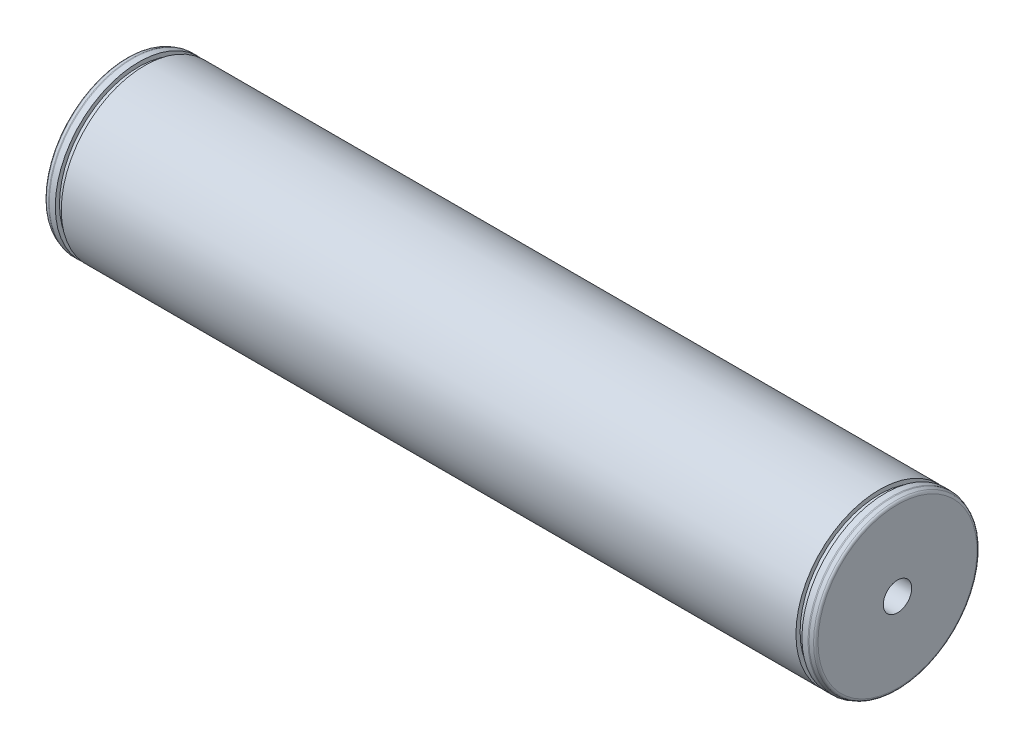
ISO-10303-21;
HEADER;
FILE_DESCRIPTION(('STEP AP214'),'2;1');
FILE_NAME('part.step','',(''),(''),'','','');
FILE_SCHEMA(('AUTOMOTIVE_DESIGN { 1 0 10303 214 1 1 1 1 }'));
ENDSEC;
DATA;
#1=APPLICATION_CONTEXT('core data for automotive mechanical design processes');
#2=APPLICATION_PROTOCOL_DEFINITION('international standard','automotive_design',2000,#1);
#3=PRODUCT_CONTEXT('',#1,'mechanical');
#4=PRODUCT('Part','Part','',(#3));
#5=PRODUCT_RELATED_PRODUCT_CATEGORY('part','',(#4));
#6=PRODUCT_DEFINITION_FORMATION('','',#4);
#7=PRODUCT_DEFINITION_CONTEXT('part definition',#1,'design');
#8=PRODUCT_DEFINITION('design','',#6,#7);
#9=PRODUCT_DEFINITION_SHAPE('','',#8);
#10=(LENGTH_UNIT() NAMED_UNIT(*) SI_UNIT(.MILLI.,.METRE.));
#11=(NAMED_UNIT(*) PLANE_ANGLE_UNIT() SI_UNIT($,.RADIAN.));
#12=(NAMED_UNIT(*) SI_UNIT($,.STERADIAN.) SOLID_ANGLE_UNIT());
#13=UNCERTAINTY_MEASURE_WITH_UNIT(LENGTH_MEASURE(1.E-05),#10,'distance_accuracy_value','');
#14=(GEOMETRIC_REPRESENTATION_CONTEXT(3) GLOBAL_UNCERTAINTY_ASSIGNED_CONTEXT((#13)) GLOBAL_UNIT_ASSIGNED_CONTEXT((#10,
#11,#12)) REPRESENTATION_CONTEXT('',''));
#15=CARTESIAN_POINT('',(0.,0.,0.));
#16=DIRECTION('',(0.,0.,1.));
#17=DIRECTION('',(1.,0.,0.));
#18=AXIS2_PLACEMENT_3D('',#15,#16,#17);
#19=CARTESIAN_POINT('',(-138.5,28.5718519932578,0.));
#20=DIRECTION('',(1.,0.,0.));
#21=DIRECTION('',(0.,0.,-1.));
#22=AXIS2_PLACEMENT_3D('',#19,#20,#21);
#23=PLANE('',#22);
#24=CARTESIAN_POINT('',(-138.5,0.,0.));
#25=DIRECTION('',(-1.,0.,0.));
#26=DIRECTION('',(0.,0.,1.));
#27=AXIS2_PLACEMENT_3D('',#24,#25,#26);
#28=CIRCLE('',#27,28.5718519932578);
#29=CARTESIAN_POINT('',(-138.5,0.,28.5718519932578));
#30=VERTEX_POINT('',#29);
#31=EDGE_CURVE('E121',#30,#30,#28,.T.);
#32=ORIENTED_EDGE('',*,*,#31,.T.);
#33=EDGE_LOOP('',(#32));
#34=FACE_BOUND('',#33,.T.);
#35=ADVANCED_FACE('F53',(#34),#23,.F.);
#36=CARTESIAN_POINT('',(118.5,0.,0.));
#37=DIRECTION('',(1.,0.,0.));
#38=DIRECTION('',(0.,0.,-1.));
#39=AXIS2_PLACEMENT_3D('',#36,#37,#38);
#40=CONICAL_SURFACE('',#39,5.1,1.0471975511966);
#41=CARTESIAN_POINT('',(115.555513627133,0.,0.));
#42=VERTEX_POINT('',#41);
#43=VERTEX_LOOP('',#42);
#44=FACE_BOUND('',#43,.T.);
#45=CARTESIAN_POINT('',(118.5,0.,0.));
#46=DIRECTION('',(-1.,0.,0.));
#47=DIRECTION('',(0.,0.,1.));
#48=AXIS2_PLACEMENT_3D('',#45,#46,#47);
#49=CIRCLE('',#48,5.1);
#50=CARTESIAN_POINT('',(118.5,0.,5.1));
#51=VERTEX_POINT('',#50);
#52=EDGE_CURVE('E11',#51,#51,#49,.T.);
#53=ORIENTED_EDGE('',*,*,#52,.F.);
#54=EDGE_LOOP('',(#53));
#55=FACE_BOUND('',#54,.T.);
#56=ADVANCED_FACE('F62',(#44,#55),#40,.F.);
#57=CARTESIAN_POINT('',(-138.5,0.,0.));
#58=DIRECTION('',(-1.,0.,0.));
#59=DIRECTION('',(0.,0.,1.));
#60=AXIS2_PLACEMENT_3D('',#57,#58,#59);
#61=CYLINDRICAL_SURFACE('',#60,5.09999999999998);
#62=ORIENTED_EDGE('',*,*,#52,.T.);
#63=EDGE_LOOP('',(#62));
#64=FACE_BOUND('',#63,.T.);
#65=CARTESIAN_POINT('',(138.5,0.,0.));
#66=DIRECTION('',(-1.,0.,0.));
#67=DIRECTION('',(0.,0.,1.));
#68=AXIS2_PLACEMENT_3D('',#65,#66,#67);
#69=CIRCLE('',#68,5.09999999999997);
#70=CARTESIAN_POINT('',(138.5,0.,5.09999999999997));
#71=VERTEX_POINT('',#70);
#72=EDGE_CURVE('E59',#71,#71,#69,.T.);
#73=ORIENTED_EDGE('',*,*,#72,.F.);
#74=EDGE_LOOP('',(#73));
#75=FACE_BOUND('',#74,.T.);
#76=ADVANCED_FACE('F65',(#64,#75),#61,.F.);
#77=CARTESIAN_POINT('',(138.5,28.5718519932578,0.));
#78=DIRECTION('',(1.,0.,0.));
#79=DIRECTION('',(0.,0.,-1.));
#80=AXIS2_PLACEMENT_3D('',#77,#78,#79);
#81=PLANE('',#80);
#82=ORIENTED_EDGE('',*,*,#72,.T.);
#83=EDGE_LOOP('',(#82));
#84=FACE_BOUND('',#83,.T.);
#85=CARTESIAN_POINT('',(138.5,0.,0.));
#86=DIRECTION('',(-1.,0.,0.));
#87=DIRECTION('',(0.,0.,1.));
#88=AXIS2_PLACEMENT_3D('',#85,#86,#87);
#89=CIRCLE('',#88,28.5718519932578);
#90=CARTESIAN_POINT('',(138.5,0.,28.5718519932578));
#91=VERTEX_POINT('',#90);
#92=EDGE_CURVE('E75',#91,#91,#89,.T.);
#93=ORIENTED_EDGE('',*,*,#92,.F.);
#94=EDGE_LOOP('',(#93));
#95=FACE_BOUND('',#94,.T.);
#96=ADVANCED_FACE('F70',(#84,#95),#81,.T.);
#97=CARTESIAN_POINT('',(137.5,0.,0.));
#98=DIRECTION('',(-1.,0.,0.));
#99=DIRECTION('',(0.,0.,1.));
#100=AXIS2_PLACEMENT_3D('',#97,#98,#99);
#101=TOROIDAL_SURFACE('',#100,28.5718519932578,1.);
#102=CARTESIAN_POINT('',(137.842020143326,0.,0.));
#103=DIRECTION('',(-1.,0.,0.));
#104=DIRECTION('',(0.,0.,1.));
#105=AXIS2_PLACEMENT_3D('',#102,#103,#104);
#106=CIRCLE('',#105,29.5115446140437);
#107=CARTESIAN_POINT('',(137.842020143326,0.,29.5115446140437));
#108=VERTEX_POINT('',#107);
#109=EDGE_CURVE('E77',#108,#108,#106,.T.);
#110=ORIENTED_EDGE('',*,*,#109,.F.);
#111=EDGE_LOOP('',(#110));
#112=FACE_BOUND('',#111,.T.);
#113=ORIENTED_EDGE('',*,*,#92,.T.);
#114=EDGE_LOOP('',(#113));
#115=FACE_BOUND('',#114,.T.);
#116=ADVANCED_FACE('F158',(#112,#115),#101,.T.);
#117=CARTESIAN_POINT('',(137.842020143326,0.,0.));
#118=DIRECTION('',(-1.,0.,0.));
#119=DIRECTION('',(0.,0.,1.));
#120=AXIS2_PLACEMENT_3D('',#117,#118,#119);
#121=CONICAL_SURFACE('',#120,29.5115446140437,0.349065850398852);
#122=CARTESIAN_POINT('',(136.665693162617,0.,0.));
#123=DIRECTION('',(-1.,0.,0.));
#124=DIRECTION('',(0.,0.,1.));
#125=AXIS2_PLACEMENT_3D('',#122,#123,#124);
#126=CIRCLE('',#125,29.9396926207858);
#127=CARTESIAN_POINT('',(136.665693162617,0.,29.9396926207858));
#128=VERTEX_POINT('',#127);
#129=EDGE_CURVE('E82',#128,#128,#126,.T.);
#130=ORIENTED_EDGE('',*,*,#129,.F.);
#131=EDGE_LOOP('',(#130));
#132=FACE_BOUND('',#131,.T.);
#133=ORIENTED_EDGE('',*,*,#109,.T.);
#134=EDGE_LOOP('',(#133));
#135=FACE_BOUND('',#134,.T.);
#136=ADVANCED_FACE('F165',(#132,#135),#121,.T.);
#137=CARTESIAN_POINT('',(136.323673019292,0.,0.));
#138=DIRECTION('',(-1.,0.,0.));
#139=DIRECTION('',(0.,0.,1.));
#140=AXIS2_PLACEMENT_3D('',#137,#138,#139);
#141=TOROIDAL_SURFACE('',#140,28.9999999999999,1.);
#142=ORIENTED_EDGE('',*,*,#129,.T.);
#143=EDGE_LOOP('',(#142));
#144=FACE_BOUND('',#143,.T.);
#145=CARTESIAN_POINT('',(136.323673019292,0.,0.));
#146=DIRECTION('',(-1.,0.,0.));
#147=DIRECTION('',(0.,0.,1.));
#148=AXIS2_PLACEMENT_3D('',#145,#146,#147);
#149=CIRCLE('',#148,29.9999999999999);
#150=CARTESIAN_POINT('',(136.323673019292,0.,29.9999999999999));
#151=VERTEX_POINT('',#150);
#152=EDGE_CURVE('E85',#151,#151,#149,.T.);
#153=ORIENTED_EDGE('',*,*,#152,.F.);
#154=EDGE_LOOP('',(#153));
#155=FACE_BOUND('',#154,.T.);
#156=ADVANCED_FACE('F173',(#144,#155),#141,.T.);
#157=CARTESIAN_POINT('',(-138.5,0.,0.));
#158=DIRECTION('',(-1.,0.,0.));
#159=DIRECTION('',(0.,0.,1.));
#160=AXIS2_PLACEMENT_3D('',#157,#158,#159);
#161=CYLINDRICAL_SURFACE('',#160,29.9999999999999);
#162=ORIENTED_EDGE('',*,*,#152,.T.);
#163=EDGE_LOOP('',(#162));
#164=FACE_BOUND('',#163,.T.);
#165=CARTESIAN_POINT('',(134.15,0.,0.));
#166=DIRECTION('',(-1.,0.,0.));
#167=DIRECTION('',(0.,0.,1.));
#168=AXIS2_PLACEMENT_3D('',#165,#166,#167);
#169=CIRCLE('',#168,29.9999999999999);
#170=CARTESIAN_POINT('',(134.15,0.,29.9999999999999));
#171=VERTEX_POINT('',#170);
#172=EDGE_CURVE('E88',#171,#171,#169,.T.);
#173=ORIENTED_EDGE('',*,*,#172,.F.);
#174=EDGE_LOOP('',(#173));
#175=FACE_BOUND('',#174,.T.);
#176=ADVANCED_FACE('F181',(#164,#175),#161,.T.);
#177=CARTESIAN_POINT('',(134.15,28.5000000000001,0.));
#178=DIRECTION('',(-1.,0.,0.));
#179=DIRECTION('',(0.,0.,1.));
#180=AXIS2_PLACEMENT_3D('',#177,#178,#179);
#181=PLANE('',#180);
#182=ORIENTED_EDGE('',*,*,#172,.T.);
#183=EDGE_LOOP('',(#182));
#184=FACE_BOUND('',#183,.T.);
#185=CARTESIAN_POINT('',(134.15,0.,0.));
#186=DIRECTION('',(-1.,0.,0.));
#187=DIRECTION('',(0.,0.,1.));
#188=AXIS2_PLACEMENT_3D('',#185,#186,#187);
#189=CIRCLE('',#188,28.5000000000001);
#190=CARTESIAN_POINT('',(134.15,0.,28.5000000000001));
#191=VERTEX_POINT('',#190);
#192=EDGE_CURVE('E91',#191,#191,#189,.T.);
#193=ORIENTED_EDGE('',*,*,#192,.F.);
#194=EDGE_LOOP('',(#193));
#195=FACE_BOUND('',#194,.T.);
#196=ADVANCED_FACE('F189',(#184,#195),#181,.T.);
#197=CARTESIAN_POINT('',(-138.5,0.,0.));
#198=DIRECTION('',(-1.,0.,0.));
#199=DIRECTION('',(0.,0.,1.));
#200=AXIS2_PLACEMENT_3D('',#197,#198,#199);
#201=CYLINDRICAL_SURFACE('',#200,28.5000000000001);
#202=ORIENTED_EDGE('',*,*,#192,.T.);
#203=EDGE_LOOP('',(#202));
#204=FACE_BOUND('',#203,.T.);
#205=CARTESIAN_POINT('',(132.,0.,0.));
#206=DIRECTION('',(-1.,0.,0.));
#207=DIRECTION('',(0.,0.,1.));
#208=AXIS2_PLACEMENT_3D('',#205,#206,#207);
#209=CIRCLE('',#208,28.5000000000001);
#210=CARTESIAN_POINT('',(132.,0.,28.5000000000001));
#211=VERTEX_POINT('',#210);
#212=EDGE_CURVE('E94',#211,#211,#209,.T.);
#213=ORIENTED_EDGE('',*,*,#212,.F.);
#214=EDGE_LOOP('',(#213));
#215=FACE_BOUND('',#214,.T.);
#216=ADVANCED_FACE('F197',(#204,#215),#201,.T.);
#217=CARTESIAN_POINT('',(132.,29.9999999999999,0.));
#218=DIRECTION('',(1.,0.,0.));
#219=DIRECTION('',(0.,0.,-1.));
#220=AXIS2_PLACEMENT_3D('',#217,#218,#219);
#221=PLANE('',#220);
#222=ORIENTED_EDGE('',*,*,#212,.T.);
#223=EDGE_LOOP('',(#222));
#224=FACE_BOUND('',#223,.T.);
#225=CARTESIAN_POINT('',(132.,0.,0.));
#226=DIRECTION('',(-1.,0.,0.));
#227=DIRECTION('',(0.,0.,1.));
#228=AXIS2_PLACEMENT_3D('',#225,#226,#227);
#229=CIRCLE('',#228,29.9999999999999);
#230=CARTESIAN_POINT('',(132.,0.,29.9999999999999));
#231=VERTEX_POINT('',#230);
#232=EDGE_CURVE('E97',#231,#231,#229,.T.);
#233=ORIENTED_EDGE('',*,*,#232,.F.);
#234=EDGE_LOOP('',(#233));
#235=FACE_BOUND('',#234,.T.);
#236=ADVANCED_FACE('F205',(#224,#235),#221,.T.);
#237=CARTESIAN_POINT('',(-138.5,0.,0.));
#238=DIRECTION('',(-1.,0.,0.));
#239=DIRECTION('',(0.,0.,1.));
#240=AXIS2_PLACEMENT_3D('',#237,#238,#239);
#241=CYLINDRICAL_SURFACE('',#240,29.9999999999999);
#242=CARTESIAN_POINT('',(-132.,0.,0.));
#243=DIRECTION('',(-1.,0.,0.));
#244=DIRECTION('',(0.,0.,1.));
#245=AXIS2_PLACEMENT_3D('',#242,#243,#244);
#246=CIRCLE('',#245,29.9999999999999);
#247=CARTESIAN_POINT('',(-132.,0.,29.9999999999999));
#248=VERTEX_POINT('',#247);
#249=EDGE_CURVE('E100',#248,#248,#246,.T.);
#250=ORIENTED_EDGE('',*,*,#249,.F.);
#251=EDGE_LOOP('',(#250));
#252=FACE_BOUND('',#251,.T.);
#253=ORIENTED_EDGE('',*,*,#232,.T.);
#254=EDGE_LOOP('',(#253));
#255=FACE_BOUND('',#254,.T.);
#256=ADVANCED_FACE('F213',(#252,#255),#241,.T.);
#257=CARTESIAN_POINT('',(-132.,29.9999999999999,0.));
#258=DIRECTION('',(1.,0.,0.));
#259=DIRECTION('',(0.,0.,-1.));
#260=AXIS2_PLACEMENT_3D('',#257,#258,#259);
#261=PLANE('',#260);
#262=CARTESIAN_POINT('',(-132.,0.,0.));
#263=DIRECTION('',(-1.,0.,0.));
#264=DIRECTION('',(0.,0.,1.));
#265=AXIS2_PLACEMENT_3D('',#262,#263,#264);
#266=CIRCLE('',#265,28.5000000000001);
#267=CARTESIAN_POINT('',(-132.,0.,28.5000000000001));
#268=VERTEX_POINT('',#267);
#269=EDGE_CURVE('E103',#268,#268,#266,.T.);
#270=ORIENTED_EDGE('',*,*,#269,.F.);
#271=EDGE_LOOP('',(#270));
#272=FACE_BOUND('',#271,.T.);
#273=ORIENTED_EDGE('',*,*,#249,.T.);
#274=EDGE_LOOP('',(#273));
#275=FACE_BOUND('',#274,.T.);
#276=ADVANCED_FACE('F222',(#272,#275),#261,.F.);
#277=CARTESIAN_POINT('',(-138.5,0.,0.));
#278=DIRECTION('',(-1.,0.,0.));
#279=DIRECTION('',(0.,0.,1.));
#280=AXIS2_PLACEMENT_3D('',#277,#278,#279);
#281=CYLINDRICAL_SURFACE('',#280,28.5000000000001);
#282=CARTESIAN_POINT('',(-134.15,0.,0.));
#283=DIRECTION('',(-1.,0.,0.));
#284=DIRECTION('',(0.,0.,1.));
#285=AXIS2_PLACEMENT_3D('',#282,#283,#284);
#286=CIRCLE('',#285,28.5000000000001);
#287=CARTESIAN_POINT('',(-134.15,0.,28.5000000000001));
#288=VERTEX_POINT('',#287);
#289=EDGE_CURVE('E106',#288,#288,#286,.T.);
#290=ORIENTED_EDGE('',*,*,#289,.F.);
#291=EDGE_LOOP('',(#290));
#292=FACE_BOUND('',#291,.T.);
#293=ORIENTED_EDGE('',*,*,#269,.T.);
#294=EDGE_LOOP('',(#293));
#295=FACE_BOUND('',#294,.T.);
#296=ADVANCED_FACE('F230',(#292,#295),#281,.T.);
#297=CARTESIAN_POINT('',(-134.15,28.5000000000001,0.));
#298=DIRECTION('',(-1.,0.,0.));
#299=DIRECTION('',(0.,0.,1.));
#300=AXIS2_PLACEMENT_3D('',#297,#298,#299);
#301=PLANE('',#300);
#302=CARTESIAN_POINT('',(-134.15,0.,0.));
#303=DIRECTION('',(-1.,0.,0.));
#304=DIRECTION('',(0.,0.,1.));
#305=AXIS2_PLACEMENT_3D('',#302,#303,#304);
#306=CIRCLE('',#305,29.9999999999999);
#307=CARTESIAN_POINT('',(-134.15,0.,29.9999999999999));
#308=VERTEX_POINT('',#307);
#309=EDGE_CURVE('E109',#308,#308,#306,.T.);
#310=ORIENTED_EDGE('',*,*,#309,.F.);
#311=EDGE_LOOP('',(#310));
#312=FACE_BOUND('',#311,.T.);
#313=ORIENTED_EDGE('',*,*,#289,.T.);
#314=EDGE_LOOP('',(#313));
#315=FACE_BOUND('',#314,.T.);
#316=ADVANCED_FACE('F238',(#312,#315),#301,.F.);
#317=CARTESIAN_POINT('',(-138.5,0.,0.));
#318=DIRECTION('',(-1.,0.,0.));
#319=DIRECTION('',(0.,0.,1.));
#320=AXIS2_PLACEMENT_3D('',#317,#318,#319);
#321=CYLINDRICAL_SURFACE('',#320,29.9999999999999);
#322=CARTESIAN_POINT('',(-136.323673019292,0.,0.));
#323=DIRECTION('',(-1.,0.,0.));
#324=DIRECTION('',(0.,0.,1.));
#325=AXIS2_PLACEMENT_3D('',#322,#323,#324);
#326=CIRCLE('',#325,29.9999999999999);
#327=CARTESIAN_POINT('',(-136.323673019292,0.,29.9999999999999));
#328=VERTEX_POINT('',#327);
#329=EDGE_CURVE('E112',#328,#328,#326,.T.);
#330=ORIENTED_EDGE('',*,*,#329,.F.);
#331=EDGE_LOOP('',(#330));
#332=FACE_BOUND('',#331,.T.);
#333=ORIENTED_EDGE('',*,*,#309,.T.);
#334=EDGE_LOOP('',(#333));
#335=FACE_BOUND('',#334,.T.);
#336=ADVANCED_FACE('F246',(#332,#335),#321,.T.);
#337=CARTESIAN_POINT('',(-136.323673019292,0.,0.));
#338=DIRECTION('',(-1.,0.,0.));
#339=DIRECTION('',(0.,0.,1.));
#340=AXIS2_PLACEMENT_3D('',#337,#338,#339);
#341=TOROIDAL_SURFACE('',#340,28.9999999999999,1.);
#342=CARTESIAN_POINT('',(-136.665693162617,0.,0.));
#343=DIRECTION('',(-1.,0.,0.));
#344=DIRECTION('',(0.,0.,1.));
#345=AXIS2_PLACEMENT_3D('',#342,#343,#344);
#346=CIRCLE('',#345,29.9396926207858);
#347=CARTESIAN_POINT('',(-136.665693162617,0.,29.9396926207858));
#348=VERTEX_POINT('',#347);
#349=EDGE_CURVE('E115',#348,#348,#346,.T.);
#350=ORIENTED_EDGE('',*,*,#349,.F.);
#351=EDGE_LOOP('',(#350));
#352=FACE_BOUND('',#351,.T.);
#353=ORIENTED_EDGE('',*,*,#329,.T.);
#354=EDGE_LOOP('',(#353));
#355=FACE_BOUND('',#354,.T.);
#356=ADVANCED_FACE('F134',(#352,#355),#341,.T.);
#357=CARTESIAN_POINT('',(-137.842020143326,0.,0.));
#358=DIRECTION('',(1.,0.,0.));
#359=DIRECTION('',(0.,0.,-1.));
#360=AXIS2_PLACEMENT_3D('',#357,#358,#359);
#361=CONICAL_SURFACE('',#360,29.5115446140437,0.349065850398855);
#362=ORIENTED_EDGE('',*,*,#349,.T.);
#363=EDGE_LOOP('',(#362));
#364=FACE_BOUND('',#363,.T.);
#365=CARTESIAN_POINT('',(-137.842020143326,0.,0.));
#366=DIRECTION('',(-1.,0.,0.));
#367=DIRECTION('',(0.,0.,1.));
#368=AXIS2_PLACEMENT_3D('',#365,#366,#367);
#369=CIRCLE('',#368,29.5115446140437);
#370=CARTESIAN_POINT('',(-137.842020143326,0.,29.5115446140437));
#371=VERTEX_POINT('',#370);
#372=EDGE_CURVE('E118',#371,#371,#369,.T.);
#373=ORIENTED_EDGE('',*,*,#372,.F.);
#374=EDGE_LOOP('',(#373));
#375=FACE_BOUND('',#374,.T.);
#376=ADVANCED_FACE('F128',(#364,#375),#361,.T.);
#377=CARTESIAN_POINT('',(-137.5,0.,0.));
#378=DIRECTION('',(-1.,0.,0.));
#379=DIRECTION('',(0.,0.,1.));
#380=AXIS2_PLACEMENT_3D('',#377,#378,#379);
#381=TOROIDAL_SURFACE('',#380,28.5718519932578,1.);
#382=ORIENTED_EDGE('',*,*,#372,.T.);
#383=EDGE_LOOP('',(#382));
#384=FACE_BOUND('',#383,.T.);
#385=ORIENTED_EDGE('',*,*,#31,.F.);
#386=EDGE_LOOP('',(#385));
#387=FACE_BOUND('',#386,.T.);
#388=ADVANCED_FACE('F126',(#384,#387),#381,.T.);
#389=CLOSED_SHELL('',(#35,#56,#76,#96,#116,#136,#156,#176,#196,#216,#236,#256,#276,#296,#316,
#336,#356,#376,#388));
#390=MANIFOLD_SOLID_BREP('B2',#389);
#391=ADVANCED_BREP_SHAPE_REPRESENTATION('',(#18,#390),#14);
#392=SHAPE_DEFINITION_REPRESENTATION(#9,#391);
ENDSEC;
END-ISO-10303-21;
